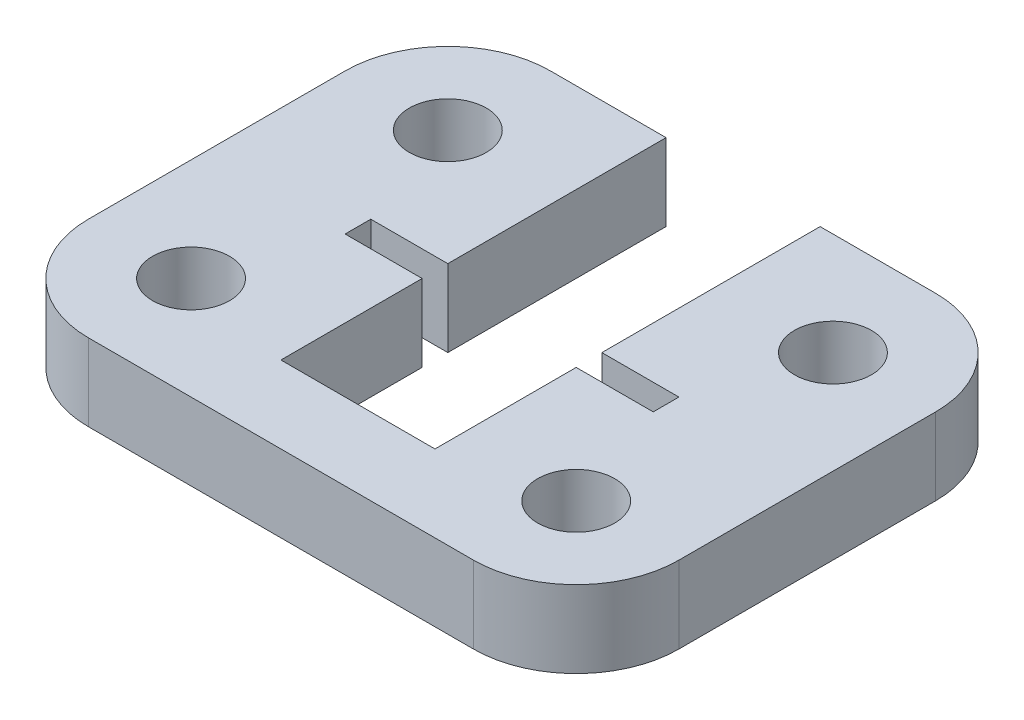
ISO-10303-21;
HEADER;
FILE_DESCRIPTION(('STEP AP214'),'2;1');
FILE_NAME('part.step','',(''),(''),'','','');
FILE_SCHEMA(('AUTOMOTIVE_DESIGN { 1 0 10303 214 1 1 1 1 }'));
ENDSEC;
DATA;
#1=APPLICATION_CONTEXT('core data for automotive mechanical design processes');
#2=APPLICATION_PROTOCOL_DEFINITION('international standard','automotive_design',2000,#1);
#3=PRODUCT_CONTEXT('',#1,'mechanical');
#4=PRODUCT('Part','Part','',(#3));
#5=PRODUCT_RELATED_PRODUCT_CATEGORY('part','',(#4));
#6=PRODUCT_DEFINITION_FORMATION('','',#4);
#7=PRODUCT_DEFINITION_CONTEXT('part definition',#1,'design');
#8=PRODUCT_DEFINITION('design','',#6,#7);
#9=PRODUCT_DEFINITION_SHAPE('','',#8);
#10=(LENGTH_UNIT() NAMED_UNIT(*) SI_UNIT(.MILLI.,.METRE.));
#11=(NAMED_UNIT(*) PLANE_ANGLE_UNIT() SI_UNIT($,.RADIAN.));
#12=(NAMED_UNIT(*) SI_UNIT($,.STERADIAN.) SOLID_ANGLE_UNIT());
#13=UNCERTAINTY_MEASURE_WITH_UNIT(LENGTH_MEASURE(1.E-05),#10,'distance_accuracy_value','');
#14=(GEOMETRIC_REPRESENTATION_CONTEXT(3) GLOBAL_UNCERTAINTY_ASSIGNED_CONTEXT((#13)) GLOBAL_UNIT_ASSIGNED_CONTEXT((#10,
#11,#12)) REPRESENTATION_CONTEXT('',''));
#15=CARTESIAN_POINT('',(0.,0.,0.));
#16=DIRECTION('',(0.,0.,1.));
#17=DIRECTION('',(1.,0.,0.));
#18=AXIS2_PLACEMENT_3D('',#15,#16,#17);
#19=CARTESIAN_POINT('',(-2.54869996880161,3.,47.5528978062099));
#20=DIRECTION('',(0.,1.,0.));
#21=DIRECTION('',(0.,0.,1.));
#22=AXIS2_PLACEMENT_3D('',#19,#20,#21);
#23=PLANE('',#22);
#24=CARTESIAN_POINT('',(-2.54870010426665,3.,57.5528978062099));
#25=DIRECTION('',(0.,1.,0.));
#26=DIRECTION('',(0.,0.,1.));
#27=AXIS2_PLACEMENT_3D('',#24,#25,#26);
#28=CIRCLE('',#27,1.5);
#29=CARTESIAN_POINT('',(-2.54870010426665,3.,59.0528978062099));
#30=VERTEX_POINT('',#29);
#31=EDGE_CURVE('E466',#30,#30,#28,.T.);
#32=ORIENTED_EDGE('',*,*,#31,.F.);
#33=EDGE_LOOP('',(#32));
#34=FACE_BOUND('',#33,.T.);
#35=CARTESIAN_POINT('',(12.4513000311984,3.,47.5528980094075));
#36=DIRECTION('',(0.,1.,0.));
#37=DIRECTION('',(0.,0.,1.));
#38=AXIS2_PLACEMENT_3D('',#35,#36,#37);
#39=CIRCLE('',#38,1.5);
#40=CARTESIAN_POINT('',(12.4513000311984,3.,49.0528980094075));
#41=VERTEX_POINT('',#40);
#42=EDGE_CURVE('E224',#41,#41,#39,.T.);
#43=ORIENTED_EDGE('',*,*,#42,.F.);
#44=EDGE_LOOP('',(#43));
#45=FACE_BOUND('',#44,.T.);
#46=DIRECTION('',(-1.,0.,0.));
#47=VECTOR('',#46,1.);
#48=CARTESIAN_POINT('',(12.4513000853844,3.,43.5528980094075));
#49=LINE('',#48,#47);
#50=CARTESIAN_POINT('',(12.4513000853844,3.,43.5528980094075));
#51=VERTEX_POINT('',#50);
#52=CARTESIAN_POINT('',(7.9513000853844,3.,43.5528980094075));
#53=VERTEX_POINT('',#52);
#54=EDGE_CURVE('E278',#51,#53,#49,.T.);
#55=ORIENTED_EDGE('',*,*,#54,.T.);
#56=DIRECTION('',(-1.354650378799E-08,0.,1.));
#57=VECTOR('',#56,1.);
#58=CARTESIAN_POINT('',(7.9513000853844,3.,43.5528980094075));
#59=LINE('',#58,#57);
#60=CARTESIAN_POINT('',(7.95129997023912,3.,52.0528980094075));
#61=VERTEX_POINT('',#60);
#62=EDGE_CURVE('E142',#53,#61,#59,.T.);
#63=ORIENTED_EDGE('',*,*,#62,.T.);
#64=DIRECTION('',(1.,0.,0.));
#65=VECTOR('',#64,1.);
#66=CARTESIAN_POINT('',(7.95129997023912,3.,52.0528980094075));
#67=LINE('',#66,#65);
#68=CARTESIAN_POINT('',(10.9512999702391,3.,52.0528980094075));
#69=VERTEX_POINT('',#68);
#70=EDGE_CURVE('E347',#61,#69,#67,.T.);
#71=ORIENTED_EDGE('',*,*,#70,.T.);
#72=DIRECTION('',(0.,0.,1.));
#73=VECTOR('',#72,1.);
#74=CARTESIAN_POINT('',(10.9512999702391,3.,52.0528980094075));
#75=LINE('',#74,#73);
#76=CARTESIAN_POINT('',(10.9512999702391,3.,53.0528978062099));
#77=VERTEX_POINT('',#76);
#78=EDGE_CURVE('E367',#69,#77,#75,.T.);
#79=ORIENTED_EDGE('',*,*,#78,.T.);
#80=DIRECTION('',(-1.,0.,0.));
#81=VECTOR('',#80,1.);
#82=CARTESIAN_POINT('',(10.9512999702391,3.,53.0528978062099));
#83=LINE('',#82,#81);
#84=CARTESIAN_POINT('',(7.95129997023912,3.,53.0528978062099));
#85=VERTEX_POINT('',#84);
#86=EDGE_CURVE('E363',#77,#85,#83,.T.);
#87=ORIENTED_EDGE('',*,*,#86,.T.);
#88=DIRECTION('',(0.,0.,1.));
#89=VECTOR('',#88,1.);
#90=CARTESIAN_POINT('',(7.95129997023912,3.,53.0528978062099));
#91=LINE('',#90,#89);
#92=CARTESIAN_POINT('',(7.95129997023912,3.,58.5528978062099));
#93=VERTEX_POINT('',#92);
#94=EDGE_CURVE('E366',#85,#93,#91,.T.);
#95=ORIENTED_EDGE('',*,*,#94,.T.);
#96=DIRECTION('',(-1.,0.,0.));
#97=VECTOR('',#96,1.);
#98=CARTESIAN_POINT('',(7.95129997023912,3.,58.5528978062099));
#99=LINE('',#98,#97);
#100=CARTESIAN_POINT('',(1.95129997023913,3.,58.5528978062099));
#101=VERTEX_POINT('',#100);
#102=EDGE_CURVE('E371',#93,#101,#99,.T.);
#103=ORIENTED_EDGE('',*,*,#102,.T.);
#104=DIRECTION('',(0.,0.,-1.));
#105=VECTOR('',#104,1.);
#106=CARTESIAN_POINT('',(1.95129997023913,3.,58.5528978062099));
#107=LINE('',#106,#105);
#108=CARTESIAN_POINT('',(1.95129997023913,3.,53.0528978062099));
#109=VERTEX_POINT('',#108);
#110=EDGE_CURVE('E378',#101,#109,#107,.T.);
#111=ORIENTED_EDGE('',*,*,#110,.T.);
#112=DIRECTION('',(-1.,0.,0.));
#113=VECTOR('',#112,1.);
#114=CARTESIAN_POINT('',(1.95129997023913,3.,53.0528978062099));
#115=LINE('',#114,#113);
#116=CARTESIAN_POINT('',(-1.04870002976087,3.,53.0528978062099));
#117=VERTEX_POINT('',#116);
#118=EDGE_CURVE('E381',#109,#117,#115,.T.);
#119=ORIENTED_EDGE('',*,*,#118,.T.);
#120=DIRECTION('',(0.,0.,-1.));
#121=VECTOR('',#120,1.);
#122=CARTESIAN_POINT('',(-1.04870002976087,3.,53.0528978062099));
#123=LINE('',#122,#121);
#124=CARTESIAN_POINT('',(-1.04870002976087,3.,52.0528978062099));
#125=VERTEX_POINT('',#124);
#126=EDGE_CURVE('E384',#117,#125,#123,.T.);
#127=ORIENTED_EDGE('',*,*,#126,.T.);
#128=DIRECTION('',(1.,0.,0.));
#129=VECTOR('',#128,1.);
#130=CARTESIAN_POINT('',(-1.04870002976087,3.,52.0528978062099));
#131=LINE('',#130,#129);
#132=CARTESIAN_POINT('',(1.95129997023911,3.,52.0528978062099));
#133=VERTEX_POINT('',#132);
#134=EDGE_CURVE('E387',#125,#133,#131,.T.);
#135=ORIENTED_EDGE('',*,*,#134,.T.);
#136=DIRECTION('',(1.354650378799E-08,0.,-1.));
#137=VECTOR('',#136,1.);
#138=CARTESIAN_POINT('',(1.95129997023911,3.,52.0528978062099));
#139=LINE('',#138,#137);
#140=CARTESIAN_POINT('',(1.9513000853844,3.,43.5528978062099));
#141=VERTEX_POINT('',#140);
#142=EDGE_CURVE('E390',#133,#141,#139,.T.);
#143=ORIENTED_EDGE('',*,*,#142,.T.);
#144=DIRECTION('',(-1.,0.,0.));
#145=VECTOR('',#144,1.);
#146=CARTESIAN_POINT('',(1.9513000853844,3.,43.5528978062099));
#147=LINE('',#146,#145);
#148=CARTESIAN_POINT('',(-2.54869991461561,3.,43.5528978062099));
#149=VERTEX_POINT('',#148);
#150=EDGE_CURVE('E393',#141,#149,#147,.T.);
#151=ORIENTED_EDGE('',*,*,#150,.T.);
#152=CARTESIAN_POINT('',(-2.54869996880161,3.,47.5528978062099));
#153=DIRECTION('',(0.,1.,0.));
#154=DIRECTION('',(0.,0.,1.));
#155=AXIS2_PLACEMENT_3D('',#152,#153,#154);
#156=CIRCLE('',#155,4.);
#157=CARTESIAN_POINT('',(-6.54869996880161,3.,47.5528977520239));
#158=VERTEX_POINT('',#157);
#159=EDGE_CURVE('E396',#149,#158,#156,.T.);
#160=ORIENTED_EDGE('',*,*,#159,.T.);
#161=DIRECTION('',(-1.35465028083814E-08,0.,1.));
#162=VECTOR('',#161,1.);
#163=CARTESIAN_POINT('',(-6.54869996880161,3.,47.5528977520239));
#164=LINE('',#163,#162);
#165=CARTESIAN_POINT('',(-6.54870010426664,3.,57.5528977520239));
#166=VERTEX_POINT('',#165);
#167=EDGE_CURVE('E399',#158,#166,#164,.T.);
#168=ORIENTED_EDGE('',*,*,#167,.T.);
#169=CARTESIAN_POINT('',(-2.54870010426665,3.,57.5528978062099));
#170=DIRECTION('',(0.,1.,0.));
#171=DIRECTION('',(0.,0.,1.));
#172=AXIS2_PLACEMENT_3D('',#169,#170,#171);
#173=CIRCLE('',#172,3.99999999999999);
#174=CARTESIAN_POINT('',(-2.54870015845266,3.,61.5528978062099));
#175=VERTEX_POINT('',#174);
#176=EDGE_CURVE('E402',#166,#175,#173,.T.);
#177=ORIENTED_EDGE('',*,*,#176,.T.);
#178=DIRECTION('',(1.,0.,1.35465032709744E-08));
#179=VECTOR('',#178,1.);
#180=CARTESIAN_POINT('',(-2.54870015845265,3.,61.5528978062099));
#181=LINE('',#180,#179);
#182=CARTESIAN_POINT('',(12.4512998415473,3.,61.5528980094075));
#183=VERTEX_POINT('',#182);
#184=EDGE_CURVE('E197',#175,#183,#181,.T.);
#185=ORIENTED_EDGE('',*,*,#184,.T.);
#186=CARTESIAN_POINT('',(12.4512998957334,3.,57.5528980094075));
#187=DIRECTION('',(0.,1.,0.));
#188=DIRECTION('',(0.,0.,1.));
#189=AXIS2_PLACEMENT_3D('',#186,#187,#188);
#190=CIRCLE('',#189,4.);
#191=CARTESIAN_POINT('',(16.4512998957333,3.,57.5528980635935));
#192=VERTEX_POINT('',#191);
#193=EDGE_CURVE('E191',#183,#192,#190,.T.);
#194=ORIENTED_EDGE('',*,*,#193,.T.);
#195=DIRECTION('',(1.35465035022708E-08,0.,-1.));
#196=VECTOR('',#195,1.);
#197=CARTESIAN_POINT('',(16.4512998957333,3.,57.5528980635935));
#198=LINE('',#197,#196);
#199=CARTESIAN_POINT('',(16.4513000311984,3.,47.5528980635935));
#200=VERTEX_POINT('',#199);
#201=EDGE_CURVE('E195',#192,#200,#198,.T.);
#202=ORIENTED_EDGE('',*,*,#201,.T.);
#203=CARTESIAN_POINT('',(12.4513000311984,3.,47.5528980094075));
#204=DIRECTION('',(0.,1.,0.));
#205=DIRECTION('',(0.,0.,1.));
#206=AXIS2_PLACEMENT_3D('',#203,#204,#205);
#207=CIRCLE('',#206,4.);
#208=EDGE_CURVE('E63',#200,#51,#207,.T.);
#209=ORIENTED_EDGE('',*,*,#208,.T.);
#210=EDGE_LOOP('',(#55,#63,#71,#79,#87,#95,#103,#111,#119,#127,#135,#143,#151,#160,#168,#177,
#185,#194,#202,#209));
#211=FACE_BOUND('',#210,.T.);
#212=CARTESIAN_POINT('',(12.4512998957334,3.,57.5528980094075));
#213=DIRECTION('',(0.,1.,0.));
#214=DIRECTION('',(0.,0.,1.));
#215=AXIS2_PLACEMENT_3D('',#212,#213,#214);
#216=CIRCLE('',#215,1.5);
#217=CARTESIAN_POINT('',(12.4512998957334,3.,59.0528980094075));
#218=VERTEX_POINT('',#217);
#219=EDGE_CURVE('E474',#218,#218,#216,.T.);
#220=ORIENTED_EDGE('',*,*,#219,.F.);
#221=EDGE_LOOP('',(#220));
#222=FACE_BOUND('',#221,.T.);
#223=CARTESIAN_POINT('',(-2.54869996880161,3.,47.5528978062099));
#224=DIRECTION('',(0.,1.,0.));
#225=DIRECTION('',(0.,0.,1.));
#226=AXIS2_PLACEMENT_3D('',#223,#224,#225);
#227=CIRCLE('',#226,1.5);
#228=CARTESIAN_POINT('',(-2.54869996880161,3.,49.0528978062099));
#229=VERTEX_POINT('',#228);
#230=EDGE_CURVE('E455',#229,#229,#227,.T.);
#231=ORIENTED_EDGE('',*,*,#230,.F.);
#232=EDGE_LOOP('',(#231));
#233=FACE_BOUND('',#232,.T.);
#234=ADVANCED_FACE('F45',(#34,#45,#211,#222,#233),#23,.T.);
#235=CARTESIAN_POINT('',(-2.54869996880161,0.,47.5528978062099));
#236=DIRECTION('',(0.,1.,0.));
#237=DIRECTION('',(0.,0.,1.));
#238=AXIS2_PLACEMENT_3D('',#235,#236,#237);
#239=PLANE('',#238);
#240=DIRECTION('',(-1.,0.,0.));
#241=VECTOR('',#240,1.);
#242=CARTESIAN_POINT('',(12.4513000853844,0.,43.5528980094075));
#243=LINE('',#242,#241);
#244=CARTESIAN_POINT('',(12.4513000853844,0.,43.5528980094075));
#245=VERTEX_POINT('',#244);
#246=CARTESIAN_POINT('',(7.9513000853844,0.,43.5528980094075));
#247=VERTEX_POINT('',#246);
#248=EDGE_CURVE('E219',#245,#247,#243,.T.);
#249=ORIENTED_EDGE('',*,*,#248,.F.);
#250=CARTESIAN_POINT('',(12.4513000311984,0.,47.5528980094075));
#251=DIRECTION('',(0.,1.,0.));
#252=DIRECTION('',(0.,0.,1.));
#253=AXIS2_PLACEMENT_3D('',#250,#251,#252);
#254=CIRCLE('',#253,4.);
#255=CARTESIAN_POINT('',(16.4513000311984,0.,47.5528980635935));
#256=VERTEX_POINT('',#255);
#257=EDGE_CURVE('E134',#256,#245,#254,.T.);
#258=ORIENTED_EDGE('',*,*,#257,.F.);
#259=DIRECTION('',(1.35465035022708E-08,0.,-1.));
#260=VECTOR('',#259,1.);
#261=CARTESIAN_POINT('',(16.4512998957333,0.,57.5528980635935));
#262=LINE('',#261,#260);
#263=CARTESIAN_POINT('',(16.4512998957333,0.,57.5528980635935));
#264=VERTEX_POINT('',#263);
#265=EDGE_CURVE('E128',#264,#256,#262,.T.);
#266=ORIENTED_EDGE('',*,*,#265,.F.);
#267=CARTESIAN_POINT('',(12.4512998957334,0.,57.5528980094075));
#268=DIRECTION('',(0.,1.,0.));
#269=DIRECTION('',(0.,0.,1.));
#270=AXIS2_PLACEMENT_3D('',#267,#268,#269);
#271=CIRCLE('',#270,4.);
#272=CARTESIAN_POINT('',(12.4512998415473,0.,61.5528980094075));
#273=VERTEX_POINT('',#272);
#274=EDGE_CURVE('E206',#273,#264,#271,.T.);
#275=ORIENTED_EDGE('',*,*,#274,.F.);
#276=DIRECTION('',(1.,0.,1.35465032709744E-08));
#277=VECTOR('',#276,1.);
#278=CARTESIAN_POINT('',(-2.54870015845265,0.,61.5528978062099));
#279=LINE('',#278,#277);
#280=CARTESIAN_POINT('',(-2.54870015845266,0.,61.5528978062099));
#281=VERTEX_POINT('',#280);
#282=EDGE_CURVE('E269',#281,#273,#279,.T.);
#283=ORIENTED_EDGE('',*,*,#282,.F.);
#284=CARTESIAN_POINT('',(-2.54870010426665,0.,57.5528978062099));
#285=DIRECTION('',(0.,1.,0.));
#286=DIRECTION('',(0.,0.,1.));
#287=AXIS2_PLACEMENT_3D('',#284,#285,#286);
#288=CIRCLE('',#287,3.99999999999999);
#289=CARTESIAN_POINT('',(-6.54870010426664,0.,57.5528977520239));
#290=VERTEX_POINT('',#289);
#291=EDGE_CURVE('E266',#290,#281,#288,.T.);
#292=ORIENTED_EDGE('',*,*,#291,.F.);
#293=DIRECTION('',(-1.35465028083814E-08,0.,1.));
#294=VECTOR('',#293,1.);
#295=CARTESIAN_POINT('',(-6.54869996880161,0.,47.5528977520239));
#296=LINE('',#295,#294);
#297=CARTESIAN_POINT('',(-6.54869996880161,0.,47.5528977520239));
#298=VERTEX_POINT('',#297);
#299=EDGE_CURVE('E263',#298,#290,#296,.T.);
#300=ORIENTED_EDGE('',*,*,#299,.F.);
#301=CARTESIAN_POINT('',(-2.54869996880161,0.,47.5528978062099));
#302=DIRECTION('',(0.,1.,0.));
#303=DIRECTION('',(0.,0.,1.));
#304=AXIS2_PLACEMENT_3D('',#301,#302,#303);
#305=CIRCLE('',#304,4.);
#306=CARTESIAN_POINT('',(-2.54869991461561,0.,43.5528978062099));
#307=VERTEX_POINT('',#306);
#308=EDGE_CURVE('E260',#307,#298,#305,.T.);
#309=ORIENTED_EDGE('',*,*,#308,.F.);
#310=DIRECTION('',(-1.,0.,0.));
#311=VECTOR('',#310,1.);
#312=CARTESIAN_POINT('',(1.9513000853844,0.,43.5528978062099));
#313=LINE('',#312,#311);
#314=CARTESIAN_POINT('',(1.9513000853844,0.,43.5528978062099));
#315=VERTEX_POINT('',#314);
#316=EDGE_CURVE('E257',#315,#307,#313,.T.);
#317=ORIENTED_EDGE('',*,*,#316,.F.);
#318=DIRECTION('',(1.354650378799E-08,0.,-1.));
#319=VECTOR('',#318,1.);
#320=CARTESIAN_POINT('',(1.95129997023911,0.,52.0528978062099));
#321=LINE('',#320,#319);
#322=CARTESIAN_POINT('',(1.95129997023911,0.,52.0528978062099));
#323=VERTEX_POINT('',#322);
#324=EDGE_CURVE('E254',#323,#315,#321,.T.);
#325=ORIENTED_EDGE('',*,*,#324,.F.);
#326=DIRECTION('',(1.,0.,0.));
#327=VECTOR('',#326,1.);
#328=CARTESIAN_POINT('',(-1.04870002976087,0.,52.0528978062099));
#329=LINE('',#328,#327);
#330=CARTESIAN_POINT('',(-1.04870002976087,0.,52.0528978062099));
#331=VERTEX_POINT('',#330);
#332=EDGE_CURVE('E251',#331,#323,#329,.T.);
#333=ORIENTED_EDGE('',*,*,#332,.F.);
#334=DIRECTION('',(0.,0.,-1.));
#335=VECTOR('',#334,1.);
#336=CARTESIAN_POINT('',(-1.04870002976087,0.,53.0528978062099));
#337=LINE('',#336,#335);
#338=CARTESIAN_POINT('',(-1.04870002976087,0.,53.0528978062099));
#339=VERTEX_POINT('',#338);
#340=EDGE_CURVE('E248',#339,#331,#337,.T.);
#341=ORIENTED_EDGE('',*,*,#340,.F.);
#342=DIRECTION('',(-1.,0.,0.));
#343=VECTOR('',#342,1.);
#344=CARTESIAN_POINT('',(1.95129997023913,0.,53.0528978062099));
#345=LINE('',#344,#343);
#346=CARTESIAN_POINT('',(1.95129997023913,0.,53.0528978062099));
#347=VERTEX_POINT('',#346);
#348=EDGE_CURVE('E245',#347,#339,#345,.T.);
#349=ORIENTED_EDGE('',*,*,#348,.F.);
#350=DIRECTION('',(0.,0.,-1.));
#351=VECTOR('',#350,1.);
#352=CARTESIAN_POINT('',(1.95129997023913,0.,58.5528978062099));
#353=LINE('',#352,#351);
#354=CARTESIAN_POINT('',(1.95129997023913,0.,58.5528978062099));
#355=VERTEX_POINT('',#354);
#356=EDGE_CURVE('E242',#355,#347,#353,.T.);
#357=ORIENTED_EDGE('',*,*,#356,.F.);
#358=DIRECTION('',(-1.,0.,0.));
#359=VECTOR('',#358,1.);
#360=CARTESIAN_POINT('',(7.95129997023912,0.,58.5528978062099));
#361=LINE('',#360,#359);
#362=CARTESIAN_POINT('',(7.95129997023912,0.,58.5528978062099));
#363=VERTEX_POINT('',#362);
#364=EDGE_CURVE('E239',#363,#355,#361,.T.);
#365=ORIENTED_EDGE('',*,*,#364,.F.);
#366=DIRECTION('',(0.,0.,1.));
#367=VECTOR('',#366,1.);
#368=CARTESIAN_POINT('',(7.95129997023912,0.,53.0528978062099));
#369=LINE('',#368,#367);
#370=CARTESIAN_POINT('',(7.95129997023912,0.,53.0528978062099));
#371=VERTEX_POINT('',#370);
#372=EDGE_CURVE('E236',#371,#363,#369,.T.);
#373=ORIENTED_EDGE('',*,*,#372,.F.);
#374=DIRECTION('',(-1.,0.,0.));
#375=VECTOR('',#374,1.);
#376=CARTESIAN_POINT('',(10.9512999702391,0.,53.0528978062099));
#377=LINE('',#376,#375);
#378=CARTESIAN_POINT('',(10.9512999702391,0.,53.0528978062099));
#379=VERTEX_POINT('',#378);
#380=EDGE_CURVE('E233',#379,#371,#377,.T.);
#381=ORIENTED_EDGE('',*,*,#380,.F.);
#382=DIRECTION('',(0.,0.,1.));
#383=VECTOR('',#382,1.);
#384=CARTESIAN_POINT('',(10.9512999702391,0.,52.0528980094075));
#385=LINE('',#384,#383);
#386=CARTESIAN_POINT('',(10.9512999702391,0.,52.0528980094075));
#387=VERTEX_POINT('',#386);
#388=EDGE_CURVE('E230',#387,#379,#385,.T.);
#389=ORIENTED_EDGE('',*,*,#388,.F.);
#390=DIRECTION('',(1.,0.,0.));
#391=VECTOR('',#390,1.);
#392=CARTESIAN_POINT('',(7.95129997023912,0.,52.0528980094075));
#393=LINE('',#392,#391);
#394=CARTESIAN_POINT('',(7.95129997023912,0.,52.0528980094075));
#395=VERTEX_POINT('',#394);
#396=EDGE_CURVE('E227',#395,#387,#393,.T.);
#397=ORIENTED_EDGE('',*,*,#396,.F.);
#398=DIRECTION('',(-1.354650378799E-08,0.,1.));
#399=VECTOR('',#398,1.);
#400=CARTESIAN_POINT('',(7.9513000853844,0.,43.5528980094075));
#401=LINE('',#400,#399);
#402=EDGE_CURVE('E223',#247,#395,#401,.T.);
#403=ORIENTED_EDGE('',*,*,#402,.F.);
#404=EDGE_LOOP('',(#249,#258,#266,#275,#283,#292,#300,#309,#317,#325,#333,#341,#349,#357,#365,
#373,#381,#389,#397,#403));
#405=FACE_BOUND('',#404,.T.);
#406=CARTESIAN_POINT('',(12.4513000311984,0.,47.5528980094075));
#407=DIRECTION('',(0.,1.,0.));
#408=DIRECTION('',(0.,0.,1.));
#409=AXIS2_PLACEMENT_3D('',#406,#407,#408);
#410=CIRCLE('',#409,1.5);
#411=CARTESIAN_POINT('',(12.4513000311984,0.,49.0528980094075));
#412=VERTEX_POINT('',#411);
#413=EDGE_CURVE('E478',#412,#412,#410,.T.);
#414=ORIENTED_EDGE('',*,*,#413,.T.);
#415=EDGE_LOOP('',(#414));
#416=FACE_BOUND('',#415,.T.);
#417=CARTESIAN_POINT('',(12.4512998957334,0.,57.5528980094075));
#418=DIRECTION('',(0.,1.,0.));
#419=DIRECTION('',(0.,0.,1.));
#420=AXIS2_PLACEMENT_3D('',#417,#418,#419);
#421=CIRCLE('',#420,1.5);
#422=CARTESIAN_POINT('',(12.4512998957334,0.,59.0528980094075));
#423=VERTEX_POINT('',#422);
#424=EDGE_CURVE('E470',#423,#423,#421,.T.);
#425=ORIENTED_EDGE('',*,*,#424,.T.);
#426=EDGE_LOOP('',(#425));
#427=FACE_BOUND('',#426,.T.);
#428=CARTESIAN_POINT('',(-2.54870010426665,0.,57.5528978062099));
#429=DIRECTION('',(0.,1.,0.));
#430=DIRECTION('',(0.,0.,1.));
#431=AXIS2_PLACEMENT_3D('',#428,#429,#430);
#432=CIRCLE('',#431,1.5);
#433=CARTESIAN_POINT('',(-2.54870010426665,0.,59.0528978062099));
#434=VERTEX_POINT('',#433);
#435=EDGE_CURVE('E463',#434,#434,#432,.T.);
#436=ORIENTED_EDGE('',*,*,#435,.T.);
#437=EDGE_LOOP('',(#436));
#438=FACE_BOUND('',#437,.T.);
#439=CARTESIAN_POINT('',(-2.54869996880161,0.,47.5528978062099));
#440=DIRECTION('',(0.,1.,0.));
#441=DIRECTION('',(0.,0.,1.));
#442=AXIS2_PLACEMENT_3D('',#439,#440,#441);
#443=CIRCLE('',#442,1.5);
#444=CARTESIAN_POINT('',(-2.54869996880161,0.,49.0528978062099));
#445=VERTEX_POINT('',#444);
#446=EDGE_CURVE('E458',#445,#445,#443,.T.);
#447=ORIENTED_EDGE('',*,*,#446,.T.);
#448=EDGE_LOOP('',(#447));
#449=FACE_BOUND('',#448,.T.);
#450=ADVANCED_FACE('F351',(#405,#416,#427,#438,#449),#239,.F.);
#451=CARTESIAN_POINT('',(12.4513000853844,3.,43.5528980094075));
#452=DIRECTION('',(0.,0.,1.));
#453=DIRECTION('',(1.,0.,0.));
#454=AXIS2_PLACEMENT_3D('',#451,#452,#453);
#455=PLANE('',#454);
#456=ORIENTED_EDGE('',*,*,#248,.T.);
#457=DIRECTION('',(0.,-1.,0.));
#458=VECTOR('',#457,1.);
#459=CARTESIAN_POINT('',(7.9513000853844,3.,43.5528980094075));
#460=LINE('',#459,#458);
#461=EDGE_CURVE('E11',#53,#247,#460,.T.);
#462=ORIENTED_EDGE('',*,*,#461,.F.);
#463=ORIENTED_EDGE('',*,*,#54,.F.);
#464=DIRECTION('',(0.,-1.,0.));
#465=VECTOR('',#464,1.);
#466=CARTESIAN_POINT('',(12.4513000853844,3.,43.5528980094075));
#467=LINE('',#466,#465);
#468=EDGE_CURVE('E215',#51,#245,#467,.T.);
#469=ORIENTED_EDGE('',*,*,#468,.T.);
#470=EDGE_LOOP('',(#456,#462,#463,#469));
#471=FACE_BOUND('',#470,.T.);
#472=ADVANCED_FACE('F47',(#471),#455,.F.);
#473=CARTESIAN_POINT('',(7.9513000853844,3.,43.5528980094075));
#474=DIRECTION('',(1.,0.,1.354650378799E-08));
#475=DIRECTION('',(1.354650378799E-08,0.,-1.));
#476=AXIS2_PLACEMENT_3D('',#473,#474,#475);
#477=PLANE('',#476);
#478=ORIENTED_EDGE('',*,*,#402,.T.);
#479=DIRECTION('',(0.,-1.,0.));
#480=VECTOR('',#479,1.);
#481=CARTESIAN_POINT('',(7.95129997023912,3.,52.0528980094075));
#482=LINE('',#481,#480);
#483=EDGE_CURVE('E55',#61,#395,#482,.T.);
#484=ORIENTED_EDGE('',*,*,#483,.F.);
#485=ORIENTED_EDGE('',*,*,#62,.F.);
#486=ORIENTED_EDGE('',*,*,#461,.T.);
#487=EDGE_LOOP('',(#478,#484,#485,#486));
#488=FACE_BOUND('',#487,.T.);
#489=ADVANCED_FACE('F678',(#488),#477,.F.);
#490=CARTESIAN_POINT('',(7.95129997023912,3.,52.0528980094075));
#491=DIRECTION('',(0.,0.,-1.));
#492=DIRECTION('',(-1.,0.,0.));
#493=AXIS2_PLACEMENT_3D('',#490,#491,#492);
#494=PLANE('',#493);
#495=ORIENTED_EDGE('',*,*,#396,.T.);
#496=DIRECTION('',(0.,-1.,0.));
#497=VECTOR('',#496,1.);
#498=CARTESIAN_POINT('',(10.9512999702391,3.,52.0528980094075));
#499=LINE('',#498,#497);
#500=EDGE_CURVE('E337',#69,#387,#499,.T.);
#501=ORIENTED_EDGE('',*,*,#500,.F.);
#502=ORIENTED_EDGE('',*,*,#70,.F.);
#503=ORIENTED_EDGE('',*,*,#483,.T.);
#504=EDGE_LOOP('',(#495,#501,#502,#503));
#505=FACE_BOUND('',#504,.T.);
#506=ADVANCED_FACE('F345',(#505),#494,.F.);
#507=CARTESIAN_POINT('',(10.9512999702391,3.,52.0528980094075));
#508=DIRECTION('',(1.,0.,0.));
#509=DIRECTION('',(0.,0.,-1.));
#510=AXIS2_PLACEMENT_3D('',#507,#508,#509);
#511=PLANE('',#510);
#512=ORIENTED_EDGE('',*,*,#388,.T.);
#513=DIRECTION('',(0.,-1.,0.));
#514=VECTOR('',#513,1.);
#515=CARTESIAN_POINT('',(10.9512999702391,3.,53.0528978062099));
#516=LINE('',#515,#514);
#517=EDGE_CURVE('E333',#77,#379,#516,.T.);
#518=ORIENTED_EDGE('',*,*,#517,.F.);
#519=ORIENTED_EDGE('',*,*,#78,.F.);
#520=ORIENTED_EDGE('',*,*,#500,.T.);
#521=EDGE_LOOP('',(#512,#518,#519,#520));
#522=FACE_BOUND('',#521,.T.);
#523=ADVANCED_FACE('F357',(#522),#511,.F.);
#524=CARTESIAN_POINT('',(10.9512999702391,3.,53.0528978062099));
#525=DIRECTION('',(0.,0.,1.));
#526=DIRECTION('',(1.,0.,0.));
#527=AXIS2_PLACEMENT_3D('',#524,#525,#526);
#528=PLANE('',#527);
#529=ORIENTED_EDGE('',*,*,#380,.T.);
#530=DIRECTION('',(0.,-1.,0.));
#531=VECTOR('',#530,1.);
#532=CARTESIAN_POINT('',(7.95129997023912,3.,53.0528978062099));
#533=LINE('',#532,#531);
#534=EDGE_CURVE('E329',#85,#371,#533,.T.);
#535=ORIENTED_EDGE('',*,*,#534,.F.);
#536=ORIENTED_EDGE('',*,*,#86,.F.);
#537=ORIENTED_EDGE('',*,*,#517,.T.);
#538=EDGE_LOOP('',(#529,#535,#536,#537));
#539=FACE_BOUND('',#538,.T.);
#540=ADVANCED_FACE('F361',(#539),#528,.F.);
#541=CARTESIAN_POINT('',(7.95129997023912,3.,53.0528978062099));
#542=DIRECTION('',(1.,0.,0.));
#543=DIRECTION('',(0.,0.,-1.));
#544=AXIS2_PLACEMENT_3D('',#541,#542,#543);
#545=PLANE('',#544);
#546=ORIENTED_EDGE('',*,*,#372,.T.);
#547=DIRECTION('',(0.,-1.,0.));
#548=VECTOR('',#547,1.);
#549=CARTESIAN_POINT('',(7.95129997023912,3.,58.5528978062099));
#550=LINE('',#549,#548);
#551=EDGE_CURVE('E325',#93,#363,#550,.T.);
#552=ORIENTED_EDGE('',*,*,#551,.F.);
#553=ORIENTED_EDGE('',*,*,#94,.F.);
#554=ORIENTED_EDGE('',*,*,#534,.T.);
#555=EDGE_LOOP('',(#546,#552,#553,#554));
#556=FACE_BOUND('',#555,.T.);
#557=ADVANCED_FACE('F643',(#556),#545,.F.);
#558=CARTESIAN_POINT('',(7.95129997023912,3.,58.5528978062099));
#559=DIRECTION('',(0.,0.,1.));
#560=DIRECTION('',(1.,0.,0.));
#561=AXIS2_PLACEMENT_3D('',#558,#559,#560);
#562=PLANE('',#561);
#563=ORIENTED_EDGE('',*,*,#364,.T.);
#564=DIRECTION('',(0.,-1.,0.));
#565=VECTOR('',#564,1.);
#566=CARTESIAN_POINT('',(1.95129997023913,3.,58.5528978062099));
#567=LINE('',#566,#565);
#568=EDGE_CURVE('E321',#101,#355,#567,.T.);
#569=ORIENTED_EDGE('',*,*,#568,.F.);
#570=ORIENTED_EDGE('',*,*,#102,.F.);
#571=ORIENTED_EDGE('',*,*,#551,.T.);
#572=EDGE_LOOP('',(#563,#569,#570,#571));
#573=FACE_BOUND('',#572,.T.);
#574=ADVANCED_FACE('F633',(#573),#562,.F.);
#575=CARTESIAN_POINT('',(1.95129997023913,3.,58.5528978062099));
#576=DIRECTION('',(-1.,0.,0.));
#577=DIRECTION('',(0.,0.,1.));
#578=AXIS2_PLACEMENT_3D('',#575,#576,#577);
#579=PLANE('',#578);
#580=ORIENTED_EDGE('',*,*,#356,.T.);
#581=DIRECTION('',(0.,-1.,0.));
#582=VECTOR('',#581,1.);
#583=CARTESIAN_POINT('',(1.95129997023913,3.,53.0528978062099));
#584=LINE('',#583,#582);
#585=EDGE_CURVE('E317',#109,#347,#584,.T.);
#586=ORIENTED_EDGE('',*,*,#585,.F.);
#587=ORIENTED_EDGE('',*,*,#110,.F.);
#588=ORIENTED_EDGE('',*,*,#568,.T.);
#589=EDGE_LOOP('',(#580,#586,#587,#588));
#590=FACE_BOUND('',#589,.T.);
#591=ADVANCED_FACE('F623',(#590),#579,.F.);
#592=CARTESIAN_POINT('',(1.95129997023913,3.,53.0528978062099));
#593=DIRECTION('',(0.,0.,1.));
#594=DIRECTION('',(1.,0.,0.));
#595=AXIS2_PLACEMENT_3D('',#592,#593,#594);
#596=PLANE('',#595);
#597=ORIENTED_EDGE('',*,*,#348,.T.);
#598=DIRECTION('',(0.,-1.,0.));
#599=VECTOR('',#598,1.);
#600=CARTESIAN_POINT('',(-1.04870002976087,3.,53.0528978062099));
#601=LINE('',#600,#599);
#602=EDGE_CURVE('E313',#117,#339,#601,.T.);
#603=ORIENTED_EDGE('',*,*,#602,.F.);
#604=ORIENTED_EDGE('',*,*,#118,.F.);
#605=ORIENTED_EDGE('',*,*,#585,.T.);
#606=EDGE_LOOP('',(#597,#603,#604,#605));
#607=FACE_BOUND('',#606,.T.);
#608=ADVANCED_FACE('F613',(#607),#596,.F.);
#609=CARTESIAN_POINT('',(-1.04870002976087,3.,53.0528978062099));
#610=DIRECTION('',(-1.,0.,0.));
#611=DIRECTION('',(0.,0.,1.));
#612=AXIS2_PLACEMENT_3D('',#609,#610,#611);
#613=PLANE('',#612);
#614=ORIENTED_EDGE('',*,*,#340,.T.);
#615=DIRECTION('',(0.,-1.,0.));
#616=VECTOR('',#615,1.);
#617=CARTESIAN_POINT('',(-1.04870002976087,3.,52.0528978062099));
#618=LINE('',#617,#616);
#619=EDGE_CURVE('E309',#125,#331,#618,.T.);
#620=ORIENTED_EDGE('',*,*,#619,.F.);
#621=ORIENTED_EDGE('',*,*,#126,.F.);
#622=ORIENTED_EDGE('',*,*,#602,.T.);
#623=EDGE_LOOP('',(#614,#620,#621,#622));
#624=FACE_BOUND('',#623,.T.);
#625=ADVANCED_FACE('F603',(#624),#613,.F.);
#626=CARTESIAN_POINT('',(-1.04870002976087,3.,52.0528978062099));
#627=DIRECTION('',(0.,0.,-1.));
#628=DIRECTION('',(-1.,0.,0.));
#629=AXIS2_PLACEMENT_3D('',#626,#627,#628);
#630=PLANE('',#629);
#631=ORIENTED_EDGE('',*,*,#332,.T.);
#632=DIRECTION('',(0.,-1.,0.));
#633=VECTOR('',#632,1.);
#634=CARTESIAN_POINT('',(1.95129997023911,3.,52.0528978062099));
#635=LINE('',#634,#633);
#636=EDGE_CURVE('E305',#133,#323,#635,.T.);
#637=ORIENTED_EDGE('',*,*,#636,.F.);
#638=ORIENTED_EDGE('',*,*,#134,.F.);
#639=ORIENTED_EDGE('',*,*,#619,.T.);
#640=EDGE_LOOP('',(#631,#637,#638,#639));
#641=FACE_BOUND('',#640,.T.);
#642=ADVANCED_FACE('F593',(#641),#630,.F.);
#643=CARTESIAN_POINT('',(1.95129997023911,3.,52.0528978062099));
#644=DIRECTION('',(-1.,0.,-1.354650378799E-08));
#645=DIRECTION('',(-1.354650378799E-08,0.,1.));
#646=AXIS2_PLACEMENT_3D('',#643,#644,#645);
#647=PLANE('',#646);
#648=ORIENTED_EDGE('',*,*,#324,.T.);
#649=DIRECTION('',(0.,-1.,0.));
#650=VECTOR('',#649,1.);
#651=CARTESIAN_POINT('',(1.9513000853844,3.,43.5528978062099));
#652=LINE('',#651,#650);
#653=EDGE_CURVE('E301',#141,#315,#652,.T.);
#654=ORIENTED_EDGE('',*,*,#653,.F.);
#655=ORIENTED_EDGE('',*,*,#142,.F.);
#656=ORIENTED_EDGE('',*,*,#636,.T.);
#657=EDGE_LOOP('',(#648,#654,#655,#656));
#658=FACE_BOUND('',#657,.T.);
#659=ADVANCED_FACE('F583',(#658),#647,.F.);
#660=CARTESIAN_POINT('',(1.9513000853844,3.,43.5528978062099));
#661=DIRECTION('',(0.,0.,1.));
#662=DIRECTION('',(1.,0.,0.));
#663=AXIS2_PLACEMENT_3D('',#660,#661,#662);
#664=PLANE('',#663);
#665=ORIENTED_EDGE('',*,*,#316,.T.);
#666=DIRECTION('',(0.,-1.,0.));
#667=VECTOR('',#666,1.);
#668=CARTESIAN_POINT('',(-2.54869991461561,3.,43.5528978062099));
#669=LINE('',#668,#667);
#670=EDGE_CURVE('E297',#149,#307,#669,.T.);
#671=ORIENTED_EDGE('',*,*,#670,.F.);
#672=ORIENTED_EDGE('',*,*,#150,.F.);
#673=ORIENTED_EDGE('',*,*,#653,.T.);
#674=EDGE_LOOP('',(#665,#671,#672,#673));
#675=FACE_BOUND('',#674,.T.);
#676=ADVANCED_FACE('F573',(#675),#664,.F.);
#677=CARTESIAN_POINT('',(-2.54869996880161,3.,47.5528978062099));
#678=DIRECTION('',(0.,-1.,0.));
#679=DIRECTION('',(0.,0.,-1.));
#680=AXIS2_PLACEMENT_3D('',#677,#678,#679);
#681=CYLINDRICAL_SURFACE('',#680,4.);
#682=ORIENTED_EDGE('',*,*,#308,.T.);
#683=DIRECTION('',(0.,-1.,0.));
#684=VECTOR('',#683,1.);
#685=CARTESIAN_POINT('',(-6.54869996880161,3.,47.5528977520239));
#686=LINE('',#685,#684);
#687=EDGE_CURVE('E293',#158,#298,#686,.T.);
#688=ORIENTED_EDGE('',*,*,#687,.F.);
#689=ORIENTED_EDGE('',*,*,#159,.F.);
#690=ORIENTED_EDGE('',*,*,#670,.T.);
#691=EDGE_LOOP('',(#682,#688,#689,#690));
#692=FACE_BOUND('',#691,.T.);
#693=ADVANCED_FACE('F563',(#692),#681,.T.);
#694=CARTESIAN_POINT('',(-6.54869996880161,3.,47.5528977520239));
#695=DIRECTION('',(1.,0.,1.35465028083814E-08));
#696=DIRECTION('',(1.35465028083814E-08,0.,-1.));
#697=AXIS2_PLACEMENT_3D('',#694,#695,#696);
#698=PLANE('',#697);
#699=ORIENTED_EDGE('',*,*,#299,.T.);
#700=DIRECTION('',(0.,-1.,0.));
#701=VECTOR('',#700,1.);
#702=CARTESIAN_POINT('',(-6.54870010426664,3.,57.5528977520239));
#703=LINE('',#702,#701);
#704=EDGE_CURVE('E289',#166,#290,#703,.T.);
#705=ORIENTED_EDGE('',*,*,#704,.F.);
#706=ORIENTED_EDGE('',*,*,#167,.F.);
#707=ORIENTED_EDGE('',*,*,#687,.T.);
#708=EDGE_LOOP('',(#699,#705,#706,#707));
#709=FACE_BOUND('',#708,.T.);
#710=ADVANCED_FACE('F554',(#709),#698,.F.);
#711=CARTESIAN_POINT('',(-2.54870010426665,3.,57.5528978062099));
#712=DIRECTION('',(0.,-1.,0.));
#713=DIRECTION('',(0.,0.,-1.));
#714=AXIS2_PLACEMENT_3D('',#711,#712,#713);
#715=CYLINDRICAL_SURFACE('',#714,3.99999999999999);
#716=ORIENTED_EDGE('',*,*,#291,.T.);
#717=DIRECTION('',(0.,-1.,0.));
#718=VECTOR('',#717,1.);
#719=CARTESIAN_POINT('',(-2.54870015845266,3.,61.5528978062099));
#720=LINE('',#719,#718);
#721=EDGE_CURVE('E285',#175,#281,#720,.T.);
#722=ORIENTED_EDGE('',*,*,#721,.F.);
#723=ORIENTED_EDGE('',*,*,#176,.F.);
#724=ORIENTED_EDGE('',*,*,#704,.T.);
#725=EDGE_LOOP('',(#716,#722,#723,#724));
#726=FACE_BOUND('',#725,.T.);
#727=ADVANCED_FACE('F410',(#726),#715,.T.);
#728=CARTESIAN_POINT('',(-2.54870015845265,3.,61.5528978062099));
#729=DIRECTION('',(1.35465032709744E-08,0.,-1.));
#730=DIRECTION('',(-1.,0.,-1.35465032709744E-08));
#731=AXIS2_PLACEMENT_3D('',#728,#729,#730);
#732=PLANE('',#731);
#733=ORIENTED_EDGE('',*,*,#282,.T.);
#734=DIRECTION('',(0.,-1.,0.));
#735=VECTOR('',#734,1.);
#736=CARTESIAN_POINT('',(12.4512998415473,3.,61.5528980094075));
#737=LINE('',#736,#735);
#738=EDGE_CURVE('E208',#183,#273,#737,.T.);
#739=ORIENTED_EDGE('',*,*,#738,.F.);
#740=ORIENTED_EDGE('',*,*,#184,.F.);
#741=ORIENTED_EDGE('',*,*,#721,.T.);
#742=EDGE_LOOP('',(#733,#739,#740,#741));
#743=FACE_BOUND('',#742,.T.);
#744=ADVANCED_FACE('F414',(#743),#732,.F.);
#745=CARTESIAN_POINT('',(12.4512998957334,3.,57.5528980094075));
#746=DIRECTION('',(0.,-1.,0.));
#747=DIRECTION('',(0.,0.,-1.));
#748=AXIS2_PLACEMENT_3D('',#745,#746,#747);
#749=CYLINDRICAL_SURFACE('',#748,4.);
#750=ORIENTED_EDGE('',*,*,#274,.T.);
#751=DIRECTION('',(0.,-1.,0.));
#752=VECTOR('',#751,1.);
#753=CARTESIAN_POINT('',(16.4512998957333,3.,57.5528980635935));
#754=LINE('',#753,#752);
#755=EDGE_CURVE('E203',#192,#264,#754,.T.);
#756=ORIENTED_EDGE('',*,*,#755,.F.);
#757=ORIENTED_EDGE('',*,*,#193,.F.);
#758=ORIENTED_EDGE('',*,*,#738,.T.);
#759=EDGE_LOOP('',(#750,#756,#757,#758));
#760=FACE_BOUND('',#759,.T.);
#761=ADVANCED_FACE('F204',(#760),#749,.T.);
#762=CARTESIAN_POINT('',(16.4512998957333,3.,57.5528980635935));
#763=DIRECTION('',(-1.,0.,-1.35465035022708E-08));
#764=DIRECTION('',(-1.35465035022708E-08,0.,1.));
#765=AXIS2_PLACEMENT_3D('',#762,#763,#764);
#766=PLANE('',#765);
#767=ORIENTED_EDGE('',*,*,#265,.T.);
#768=DIRECTION('',(0.,-1.,0.));
#769=VECTOR('',#768,1.);
#770=CARTESIAN_POINT('',(16.4513000311984,3.,47.5528980635935));
#771=LINE('',#770,#769);
#772=EDGE_CURVE('E209',#200,#256,#771,.T.);
#773=ORIENTED_EDGE('',*,*,#772,.F.);
#774=ORIENTED_EDGE('',*,*,#201,.F.);
#775=ORIENTED_EDGE('',*,*,#755,.T.);
#776=EDGE_LOOP('',(#767,#773,#774,#775));
#777=FACE_BOUND('',#776,.T.);
#778=ADVANCED_FACE('F211',(#777),#766,.F.);
#779=CARTESIAN_POINT('',(12.4513000311984,3.,47.5528980094075));
#780=DIRECTION('',(0.,-1.,0.));
#781=DIRECTION('',(0.,0.,-1.));
#782=AXIS2_PLACEMENT_3D('',#779,#780,#781);
#783=CYLINDRICAL_SURFACE('',#782,4.);
#784=ORIENTED_EDGE('',*,*,#257,.T.);
#785=ORIENTED_EDGE('',*,*,#468,.F.);
#786=ORIENTED_EDGE('',*,*,#208,.F.);
#787=ORIENTED_EDGE('',*,*,#772,.T.);
#788=EDGE_LOOP('',(#784,#785,#786,#787));
#789=FACE_BOUND('',#788,.T.);
#790=ADVANCED_FACE('F418',(#789),#783,.T.);
#791=CARTESIAN_POINT('',(12.4513000311984,3.,47.5528980094075));
#792=DIRECTION('',(0.,-1.,0.));
#793=DIRECTION('',(0.,0.,-1.));
#794=AXIS2_PLACEMENT_3D('',#791,#792,#793);
#795=CYLINDRICAL_SURFACE('',#794,1.5);
#796=ORIENTED_EDGE('',*,*,#42,.T.);
#797=EDGE_LOOP('',(#796));
#798=FACE_BOUND('',#797,.T.);
#799=ORIENTED_EDGE('',*,*,#413,.F.);
#800=EDGE_LOOP('',(#799));
#801=FACE_BOUND('',#800,.T.);
#802=ADVANCED_FACE('F420',(#798,#801),#795,.F.);
#803=CARTESIAN_POINT('',(12.4512998957334,3.,57.5528980094075));
#804=DIRECTION('',(0.,-1.,0.));
#805=DIRECTION('',(0.,0.,-1.));
#806=AXIS2_PLACEMENT_3D('',#803,#804,#805);
#807=CYLINDRICAL_SURFACE('',#806,1.5);
#808=ORIENTED_EDGE('',*,*,#219,.T.);
#809=EDGE_LOOP('',(#808));
#810=FACE_BOUND('',#809,.T.);
#811=ORIENTED_EDGE('',*,*,#424,.F.);
#812=EDGE_LOOP('',(#811));
#813=FACE_BOUND('',#812,.T.);
#814=ADVANCED_FACE('F426',(#810,#813),#807,.F.);
#815=CARTESIAN_POINT('',(-2.54870010426665,3.,57.5528978062099));
#816=DIRECTION('',(0.,-1.,0.));
#817=DIRECTION('',(0.,0.,-1.));
#818=AXIS2_PLACEMENT_3D('',#815,#816,#817);
#819=CYLINDRICAL_SURFACE('',#818,1.5);
#820=ORIENTED_EDGE('',*,*,#31,.T.);
#821=EDGE_LOOP('',(#820));
#822=FACE_BOUND('',#821,.T.);
#823=ORIENTED_EDGE('',*,*,#435,.F.);
#824=EDGE_LOOP('',(#823));
#825=FACE_BOUND('',#824,.T.);
#826=ADVANCED_FACE('F442',(#822,#825),#819,.F.);
#827=CARTESIAN_POINT('',(-2.54869996880161,3.,47.5528978062099));
#828=DIRECTION('',(0.,-1.,0.));
#829=DIRECTION('',(0.,0.,-1.));
#830=AXIS2_PLACEMENT_3D('',#827,#828,#829);
#831=CYLINDRICAL_SURFACE('',#830,1.5);
#832=ORIENTED_EDGE('',*,*,#230,.T.);
#833=EDGE_LOOP('',(#832));
#834=FACE_BOUND('',#833,.T.);
#835=ORIENTED_EDGE('',*,*,#446,.F.);
#836=EDGE_LOOP('',(#835));
#837=FACE_BOUND('',#836,.T.);
#838=ADVANCED_FACE('F446',(#834,#837),#831,.F.);
#839=CLOSED_SHELL('',(#234,#450,#472,#489,#506,#523,#540,#557,#574,#591,#608,#625,#642,#659,
#676,#693,#710,#727,#744,#761,#778,#790,#802,#814,#826,#838));
#840=MANIFOLD_SOLID_BREP('B2',#839);
#841=ADVANCED_BREP_SHAPE_REPRESENTATION('',(#18,#840),#14);
#842=SHAPE_DEFINITION_REPRESENTATION(#9,#841);
ENDSEC;
END-ISO-10303-21;
